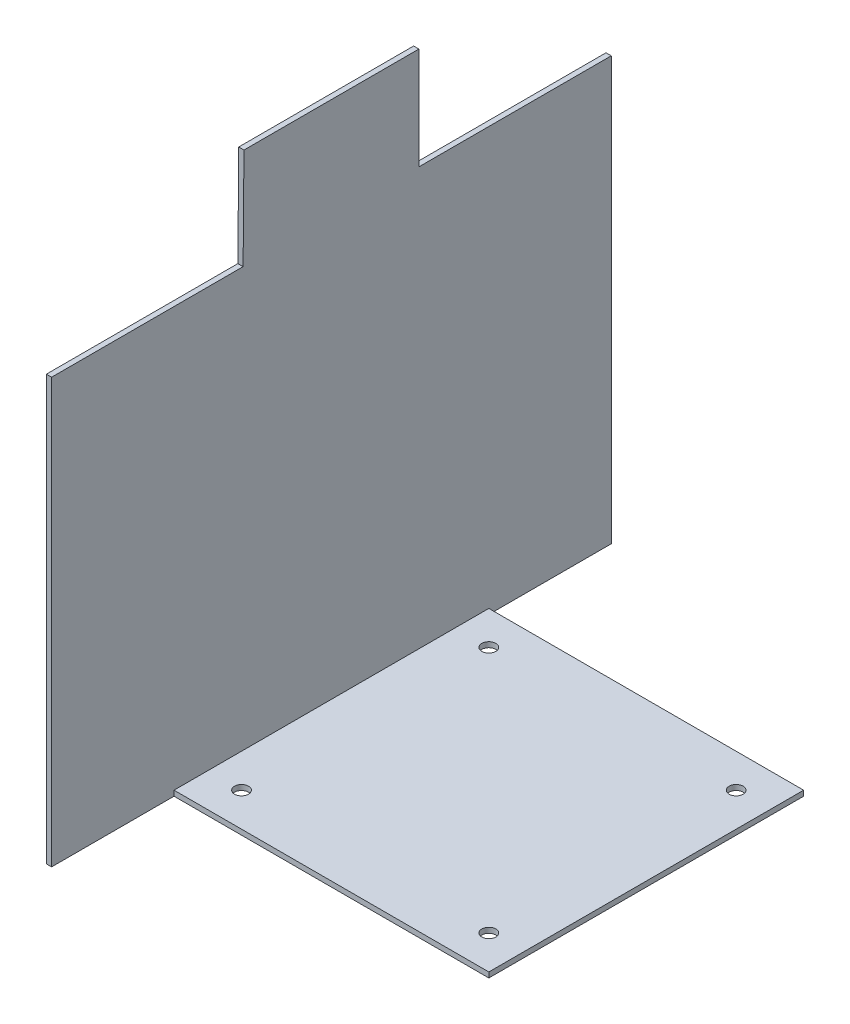
ISO-10303-21;
HEADER;
FILE_DESCRIPTION(('STEP AP214'),'2;1');
FILE_NAME('part.step','',(''),(''),'','','');
FILE_SCHEMA(('AUTOMOTIVE_DESIGN { 1 0 10303 214 1 1 1 1 }'));
ENDSEC;
DATA;
#1=APPLICATION_CONTEXT('core data for automotive mechanical design processes');
#2=APPLICATION_PROTOCOL_DEFINITION('international standard','automotive_design',2000,#1);
#3=PRODUCT_CONTEXT('',#1,'mechanical');
#4=PRODUCT('Part','Part','',(#3));
#5=PRODUCT_RELATED_PRODUCT_CATEGORY('part','',(#4));
#6=PRODUCT_DEFINITION_FORMATION('','',#4);
#7=PRODUCT_DEFINITION_CONTEXT('part definition',#1,'design');
#8=PRODUCT_DEFINITION('design','',#6,#7);
#9=PRODUCT_DEFINITION_SHAPE('','',#8);
#10=(LENGTH_UNIT() NAMED_UNIT(*) SI_UNIT(.MILLI.,.METRE.));
#11=(NAMED_UNIT(*) PLANE_ANGLE_UNIT() SI_UNIT($,.RADIAN.));
#12=(NAMED_UNIT(*) SI_UNIT($,.STERADIAN.) SOLID_ANGLE_UNIT());
#13=UNCERTAINTY_MEASURE_WITH_UNIT(LENGTH_MEASURE(1.E-05),#10,'distance_accuracy_value','');
#14=(GEOMETRIC_REPRESENTATION_CONTEXT(3) GLOBAL_UNCERTAINTY_ASSIGNED_CONTEXT((#13)) GLOBAL_UNIT_ASSIGNED_CONTEXT((#10,
#11,#12)) REPRESENTATION_CONTEXT('',''));
#15=CARTESIAN_POINT('',(0.,0.,0.));
#16=DIRECTION('',(0.,0.,1.));
#17=DIRECTION('',(1.,0.,0.));
#18=AXIS2_PLACEMENT_3D('',#15,#16,#17);
#19=CARTESIAN_POINT('',(3.,0.,0.));
#20=DIRECTION('',(-1.,0.,0.));
#21=DIRECTION('',(0.,0.,1.));
#22=AXIS2_PLACEMENT_3D('',#19,#20,#21);
#23=PLANE('',#22);
#24=DIRECTION('',(0.,0.,1.));
#25=VECTOR('',#24,1.);
#26=CARTESIAN_POINT('',(3.,150.,160.));
#27=LINE('',#26,#25);
#28=CARTESIAN_POINT('',(3.,150.,-49.9999999999999));
#29=VERTEX_POINT('',#28);
#30=CARTESIAN_POINT('',(3.,150.,50.0168067226892));
#31=VERTEX_POINT('',#30);
#32=EDGE_CURVE('E138',#29,#31,#27,.T.);
#33=ORIENTED_EDGE('',*,*,#32,.T.);
#34=DIRECTION('',(0.,0.999964693628955,-0.0084030646523393));
#35=VECTOR('',#34,1.);
#36=CARTESIAN_POINT('',(3.,152.,50.0000000000001));
#37=LINE('',#36,#35);
#38=CARTESIAN_POINT('',(3.,92.5,50.4999999999998));
#39=VERTEX_POINT('',#38);
#40=EDGE_CURVE('E121',#39,#31,#37,.T.);
#41=ORIENTED_EDGE('',*,*,#40,.F.);
#42=DIRECTION('',(0.,0.,-1.));
#43=VECTOR('',#42,1.);
#44=CARTESIAN_POINT('',(3.,92.5,50.4999999999998));
#45=LINE('',#44,#43);
#46=CARTESIAN_POINT('',(3.,92.5,160.));
#47=VERTEX_POINT('',#46);
#48=EDGE_CURVE('E128',#47,#39,#45,.T.);
#49=ORIENTED_EDGE('',*,*,#48,.F.);
#50=DIRECTION('',(0.,-1.,0.));
#51=VECTOR('',#50,1.);
#52=CARTESIAN_POINT('',(3.,-150.,160.));
#53=LINE('',#52,#51);
#54=CARTESIAN_POINT('',(3.,-150.,160.));
#55=VERTEX_POINT('',#54);
#56=EDGE_CURVE('E214',#47,#55,#53,.T.);
#57=ORIENTED_EDGE('',*,*,#56,.T.);
#58=DIRECTION('',(0.,0.,-1.));
#59=VECTOR('',#58,1.);
#60=CARTESIAN_POINT('',(3.,-150.,160.));
#61=LINE('',#60,#59);
#62=CARTESIAN_POINT('',(3.,-150.,90.));
#63=VERTEX_POINT('',#62);
#64=EDGE_CURVE('E217',#55,#63,#61,.T.);
#65=ORIENTED_EDGE('',*,*,#64,.T.);
#66=DIRECTION('',(0.,-1.,0.));
#67=VECTOR('',#66,1.);
#68=CARTESIAN_POINT('',(3.,-147.,90.));
#69=LINE('',#68,#67);
#70=CARTESIAN_POINT('',(3.,-147.,90.));
#71=VERTEX_POINT('',#70);
#72=EDGE_CURVE('E200',#71,#63,#69,.T.);
#73=ORIENTED_EDGE('',*,*,#72,.F.);
#74=DIRECTION('',(0.,0.,-1.));
#75=VECTOR('',#74,1.);
#76=CARTESIAN_POINT('',(3.,-147.,-90.));
#77=LINE('',#76,#75);
#78=CARTESIAN_POINT('',(3.,-147.,-90.));
#79=VERTEX_POINT('',#78);
#80=EDGE_CURVE('E179',#71,#79,#77,.T.);
#81=ORIENTED_EDGE('',*,*,#80,.T.);
#82=DIRECTION('',(0.,-1.,0.));
#83=VECTOR('',#82,1.);
#84=CARTESIAN_POINT('',(3.,-147.,-90.));
#85=LINE('',#84,#83);
#86=CARTESIAN_POINT('',(3.,-150.,-90.));
#87=VERTEX_POINT('',#86);
#88=EDGE_CURVE('E192',#79,#87,#85,.T.);
#89=ORIENTED_EDGE('',*,*,#88,.T.);
#90=CARTESIAN_POINT('',(3.,-150.,-160.));
#91=VERTEX_POINT('',#90);
#92=EDGE_CURVE('E216',#87,#91,#61,.T.);
#93=ORIENTED_EDGE('',*,*,#92,.T.);
#94=DIRECTION('',(0.,1.,0.));
#95=VECTOR('',#94,1.);
#96=CARTESIAN_POINT('',(3.,-150.,-160.));
#97=LINE('',#96,#95);
#98=CARTESIAN_POINT('',(3.,91.6554621848744,-160.));
#99=VERTEX_POINT('',#98);
#100=EDGE_CURVE('E209',#91,#99,#97,.T.);
#101=ORIENTED_EDGE('',*,*,#100,.T.);
#102=DIRECTION('',(0.,0.,-1.));
#103=VECTOR('',#102,1.);
#104=CARTESIAN_POINT('',(3.,91.6554621848744,-49.9999999999999));
#105=LINE('',#104,#103);
#106=CARTESIAN_POINT('',(3.,91.6554621848744,-49.9999999999999));
#107=VERTEX_POINT('',#106);
#108=EDGE_CURVE('E143',#107,#99,#105,.T.);
#109=ORIENTED_EDGE('',*,*,#108,.F.);
#110=DIRECTION('',(0.,-1.,0.));
#111=VECTOR('',#110,1.);
#112=CARTESIAN_POINT('',(3.,152.,-49.9999999999999));
#113=LINE('',#112,#111);
#114=EDGE_CURVE('E141',#29,#107,#113,.T.);
#115=ORIENTED_EDGE('',*,*,#114,.F.);
#116=EDGE_LOOP('',(#33,#41,#49,#57,#65,#73,#81,#89,#93,#101,#109,#115));
#117=FACE_BOUND('',#116,.T.);
#118=ADVANCED_FACE('F33',(#117),#23,.F.);
#119=CARTESIAN_POINT('',(3.,-150.,-160.));
#120=DIRECTION('',(0.,0.,1.));
#121=DIRECTION('',(1.,0.,0.));
#122=AXIS2_PLACEMENT_3D('',#119,#120,#121);
#123=PLANE('',#122);
#124=DIRECTION('',(0.,1.,0.));
#125=VECTOR('',#124,1.);
#126=CARTESIAN_POINT('',(0.,-150.,-160.));
#127=LINE('',#126,#125);
#128=CARTESIAN_POINT('',(0.,-150.,-160.));
#129=VERTEX_POINT('',#128);
#130=CARTESIAN_POINT('',(0.,91.6554621848744,-160.));
#131=VERTEX_POINT('',#130);
#132=EDGE_CURVE('E202',#129,#131,#127,.T.);
#133=ORIENTED_EDGE('',*,*,#132,.T.);
#134=DIRECTION('',(1.,0.,0.));
#135=VECTOR('',#134,1.);
#136=CARTESIAN_POINT('',(3.,91.6554621848744,-160.));
#137=LINE('',#136,#135);
#138=EDGE_CURVE('E148',#131,#99,#137,.T.);
#139=ORIENTED_EDGE('',*,*,#138,.T.);
#140=ORIENTED_EDGE('',*,*,#100,.F.);
#141=DIRECTION('',(-1.,0.,0.));
#142=VECTOR('',#141,1.);
#143=CARTESIAN_POINT('',(3.,-150.,-160.));
#144=LINE('',#143,#142);
#145=EDGE_CURVE('E220',#91,#129,#144,.T.);
#146=ORIENTED_EDGE('',*,*,#145,.T.);
#147=EDGE_LOOP('',(#133,#139,#140,#146));
#148=FACE_BOUND('',#147,.T.);
#149=ADVANCED_FACE('F35',(#148),#123,.F.);
#150=CARTESIAN_POINT('',(3.,150.,160.));
#151=DIRECTION('',(0.,-1.,0.));
#152=DIRECTION('',(0.,0.,-1.));
#153=AXIS2_PLACEMENT_3D('',#150,#151,#152);
#154=PLANE('',#153);
#155=DIRECTION('',(0.,0.,1.));
#156=VECTOR('',#155,1.);
#157=CARTESIAN_POINT('',(0.,150.,160.));
#158=LINE('',#157,#156);
#159=CARTESIAN_POINT('',(0.,150.,-49.9999999999999));
#160=VERTEX_POINT('',#159);
#161=CARTESIAN_POINT('',(0.,150.,50.0168067226892));
#162=VERTEX_POINT('',#161);
#163=EDGE_CURVE('E223',#160,#162,#158,.T.);
#164=ORIENTED_EDGE('',*,*,#163,.T.);
#165=DIRECTION('',(1.,0.,0.));
#166=VECTOR('',#165,1.);
#167=CARTESIAN_POINT('',(3.,150.,50.0168067226892));
#168=LINE('',#167,#166);
#169=EDGE_CURVE('E152',#162,#31,#168,.T.);
#170=ORIENTED_EDGE('',*,*,#169,.T.);
#171=ORIENTED_EDGE('',*,*,#32,.F.);
#172=DIRECTION('',(-1.,0.,0.));
#173=VECTOR('',#172,1.);
#174=CARTESIAN_POINT('',(3.,150.,-49.9999999999999));
#175=LINE('',#174,#173);
#176=EDGE_CURVE('E125',#29,#160,#175,.T.);
#177=ORIENTED_EDGE('',*,*,#176,.T.);
#178=EDGE_LOOP('',(#164,#170,#171,#177));
#179=FACE_BOUND('',#178,.T.);
#180=ADVANCED_FACE('F289',(#179),#154,.F.);
#181=CARTESIAN_POINT('',(3.,-150.,160.));
#182=DIRECTION('',(0.,0.,-1.));
#183=DIRECTION('',(-1.,0.,0.));
#184=AXIS2_PLACEMENT_3D('',#181,#182,#183);
#185=PLANE('',#184);
#186=ORIENTED_EDGE('',*,*,#56,.F.);
#187=DIRECTION('',(-1.,0.,0.));
#188=VECTOR('',#187,1.);
#189=CARTESIAN_POINT('',(3.,92.5,160.));
#190=LINE('',#189,#188);
#191=CARTESIAN_POINT('',(0.,92.5,160.));
#192=VERTEX_POINT('',#191);
#193=EDGE_CURVE('E131',#47,#192,#190,.T.);
#194=ORIENTED_EDGE('',*,*,#193,.T.);
#195=DIRECTION('',(0.,-1.,0.));
#196=VECTOR('',#195,1.);
#197=CARTESIAN_POINT('',(0.,-150.,160.));
#198=LINE('',#197,#196);
#199=CARTESIAN_POINT('',(0.,-150.,160.));
#200=VERTEX_POINT('',#199);
#201=EDGE_CURVE('E226',#192,#200,#198,.T.);
#202=ORIENTED_EDGE('',*,*,#201,.T.);
#203=DIRECTION('',(-1.,0.,0.));
#204=VECTOR('',#203,1.);
#205=CARTESIAN_POINT('',(3.,-150.,160.));
#206=LINE('',#205,#204);
#207=EDGE_CURVE('E231',#55,#200,#206,.T.);
#208=ORIENTED_EDGE('',*,*,#207,.F.);
#209=EDGE_LOOP('',(#186,#194,#202,#208));
#210=FACE_BOUND('',#209,.T.);
#211=ADVANCED_FACE('F240',(#210),#185,.F.);
#212=CARTESIAN_POINT('',(3.,-150.,160.));
#213=DIRECTION('',(0.,1.,0.));
#214=DIRECTION('',(0.,0.,1.));
#215=AXIS2_PLACEMENT_3D('',#212,#213,#214);
#216=PLANE('',#215);
#217=DIRECTION('',(0.,0.,-1.));
#218=VECTOR('',#217,1.);
#219=CARTESIAN_POINT('',(0.,-150.,160.));
#220=LINE('',#219,#218);
#221=EDGE_CURVE('E212',#200,#129,#220,.T.);
#222=ORIENTED_EDGE('',*,*,#221,.T.);
#223=ORIENTED_EDGE('',*,*,#145,.F.);
#224=ORIENTED_EDGE('',*,*,#92,.F.);
#225=DIRECTION('',(1.,0.,0.));
#226=VECTOR('',#225,1.);
#227=CARTESIAN_POINT('',(183.,-150.,-90.));
#228=LINE('',#227,#226);
#229=CARTESIAN_POINT('',(183.,-150.,-90.));
#230=VERTEX_POINT('',#229);
#231=EDGE_CURVE('E176',#87,#230,#228,.T.);
#232=ORIENTED_EDGE('',*,*,#231,.T.);
#233=DIRECTION('',(0.,0.,1.));
#234=VECTOR('',#233,1.);
#235=CARTESIAN_POINT('',(183.,-150.,90.));
#236=LINE('',#235,#234);
#237=CARTESIAN_POINT('',(183.,-150.,90.));
#238=VERTEX_POINT('',#237);
#239=EDGE_CURVE('E195',#230,#238,#236,.T.);
#240=ORIENTED_EDGE('',*,*,#239,.T.);
#241=DIRECTION('',(-1.,0.,0.));
#242=VECTOR('',#241,1.);
#243=CARTESIAN_POINT('',(3.,-150.,90.));
#244=LINE('',#243,#242);
#245=EDGE_CURVE('E183',#238,#63,#244,.T.);
#246=ORIENTED_EDGE('',*,*,#245,.T.);
#247=ORIENTED_EDGE('',*,*,#64,.F.);
#248=ORIENTED_EDGE('',*,*,#207,.T.);
#249=EDGE_LOOP('',(#222,#223,#224,#232,#240,#246,#247,#248));
#250=FACE_BOUND('',#249,.T.);
#251=CARTESIAN_POINT('',(163.71,-150.,-70.7099999999999));
#252=DIRECTION('',(0.,-1.,0.));
#253=DIRECTION('',(0.,0.,-1.));
#254=AXIS2_PLACEMENT_3D('',#251,#252,#253);
#255=CIRCLE('',#254,3.99999999999999);
#256=CARTESIAN_POINT('',(163.71,-150.,-74.7099999999999));
#257=VERTEX_POINT('',#256);
#258=EDGE_CURVE('E154',#257,#257,#255,.T.);
#259=ORIENTED_EDGE('',*,*,#258,.F.);
#260=EDGE_LOOP('',(#259));
#261=FACE_BOUND('',#260,.T.);
#262=CARTESIAN_POINT('',(163.71,-150.,70.71));
#263=DIRECTION('',(0.,-1.,0.));
#264=DIRECTION('',(0.,0.,-1.));
#265=AXIS2_PLACEMENT_3D('',#262,#263,#264);
#266=CIRCLE('',#265,3.99999999999999);
#267=CARTESIAN_POINT('',(163.71,-150.,66.71));
#268=VERTEX_POINT('',#267);
#269=EDGE_CURVE('E158',#268,#268,#266,.T.);
#270=ORIENTED_EDGE('',*,*,#269,.F.);
#271=EDGE_LOOP('',(#270));
#272=FACE_BOUND('',#271,.T.);
#273=CARTESIAN_POINT('',(22.29,-150.,70.71));
#274=DIRECTION('',(0.,-1.,0.));
#275=DIRECTION('',(0.,0.,-1.));
#276=AXIS2_PLACEMENT_3D('',#273,#274,#275);
#277=CIRCLE('',#276,4.00000000000001);
#278=CARTESIAN_POINT('',(22.29,-150.,66.71));
#279=VERTEX_POINT('',#278);
#280=EDGE_CURVE('E164',#279,#279,#277,.T.);
#281=ORIENTED_EDGE('',*,*,#280,.F.);
#282=EDGE_LOOP('',(#281));
#283=FACE_BOUND('',#282,.T.);
#284=CARTESIAN_POINT('',(22.29,-150.,-70.71));
#285=DIRECTION('',(0.,-1.,0.));
#286=DIRECTION('',(0.,0.,-1.));
#287=AXIS2_PLACEMENT_3D('',#284,#285,#286);
#288=CIRCLE('',#287,4.00000000000001);
#289=CARTESIAN_POINT('',(22.29,-150.,-74.71));
#290=VERTEX_POINT('',#289);
#291=EDGE_CURVE('E170',#290,#290,#288,.T.);
#292=ORIENTED_EDGE('',*,*,#291,.F.);
#293=EDGE_LOOP('',(#292));
#294=FACE_BOUND('',#293,.T.);
#295=ADVANCED_FACE('F248',(#250,#261,#272,#283,#294),#216,.F.);
#296=CARTESIAN_POINT('',(0.,0.,0.));
#297=DIRECTION('',(-1.,0.,0.));
#298=DIRECTION('',(0.,0.,1.));
#299=AXIS2_PLACEMENT_3D('',#296,#297,#298);
#300=PLANE('',#299);
#301=DIRECTION('',(0.,-0.999964693628954,0.0084030646523393));
#302=VECTOR('',#301,1.);
#303=CARTESIAN_POINT('',(0.,0.430871345854851,51.2736901567569));
#304=LINE('',#303,#302);
#305=CARTESIAN_POINT('',(0.,92.5,50.4999999999998));
#306=VERTEX_POINT('',#305);
#307=EDGE_CURVE('E11',#162,#306,#304,.T.);
#308=ORIENTED_EDGE('',*,*,#307,.F.);
#309=ORIENTED_EDGE('',*,*,#163,.F.);
#310=DIRECTION('',(0.,1.,0.));
#311=VECTOR('',#310,1.);
#312=CARTESIAN_POINT('',(0.,0.,-49.9999999999999));
#313=LINE('',#312,#311);
#314=CARTESIAN_POINT('',(0.,91.6554621848744,-49.9999999999999));
#315=VERTEX_POINT('',#314);
#316=EDGE_CURVE('E234',#315,#160,#313,.T.);
#317=ORIENTED_EDGE('',*,*,#316,.F.);
#318=DIRECTION('',(0.,0.,1.));
#319=VECTOR('',#318,1.);
#320=CARTESIAN_POINT('',(0.,91.6554621848744,0.));
#321=LINE('',#320,#319);
#322=EDGE_CURVE('E236',#131,#315,#321,.T.);
#323=ORIENTED_EDGE('',*,*,#322,.F.);
#324=ORIENTED_EDGE('',*,*,#132,.F.);
#325=ORIENTED_EDGE('',*,*,#221,.F.);
#326=ORIENTED_EDGE('',*,*,#201,.F.);
#327=DIRECTION('',(0.,0.,1.));
#328=VECTOR('',#327,1.);
#329=CARTESIAN_POINT('',(0.,92.5,0.));
#330=LINE('',#329,#328);
#331=EDGE_CURVE('E41',#306,#192,#330,.T.);
#332=ORIENTED_EDGE('',*,*,#331,.F.);
#333=EDGE_LOOP('',(#308,#309,#317,#323,#324,#325,#326,#332));
#334=FACE_BOUND('',#333,.T.);
#335=ADVANCED_FACE('F243',(#334),#300,.T.);
#336=CARTESIAN_POINT('',(3.,-147.,90.));
#337=DIRECTION('',(0.,0.,1.));
#338=DIRECTION('',(1.,0.,0.));
#339=AXIS2_PLACEMENT_3D('',#336,#337,#338);
#340=PLANE('',#339);
#341=ORIENTED_EDGE('',*,*,#245,.F.);
#342=DIRECTION('',(0.,-1.,0.));
#343=VECTOR('',#342,1.);
#344=CARTESIAN_POINT('',(183.,-147.,90.));
#345=LINE('',#344,#343);
#346=CARTESIAN_POINT('',(183.,-147.,90.));
#347=VERTEX_POINT('',#346);
#348=EDGE_CURVE('E203',#347,#238,#345,.T.);
#349=ORIENTED_EDGE('',*,*,#348,.F.);
#350=DIRECTION('',(-1.,0.,0.));
#351=VECTOR('',#350,1.);
#352=CARTESIAN_POINT('',(3.,-147.,90.));
#353=LINE('',#352,#351);
#354=EDGE_CURVE('E189',#347,#71,#353,.T.);
#355=ORIENTED_EDGE('',*,*,#354,.T.);
#356=ORIENTED_EDGE('',*,*,#72,.T.);
#357=EDGE_LOOP('',(#341,#349,#355,#356));
#358=FACE_BOUND('',#357,.T.);
#359=ADVANCED_FACE('F265',(#358),#340,.T.);
#360=CARTESIAN_POINT('',(183.,-147.,90.));
#361=DIRECTION('',(1.,0.,0.));
#362=DIRECTION('',(0.,0.,-1.));
#363=AXIS2_PLACEMENT_3D('',#360,#361,#362);
#364=PLANE('',#363);
#365=ORIENTED_EDGE('',*,*,#239,.F.);
#366=DIRECTION('',(0.,-1.,0.));
#367=VECTOR('',#366,1.);
#368=CARTESIAN_POINT('',(183.,-147.,-90.));
#369=LINE('',#368,#367);
#370=CARTESIAN_POINT('',(183.,-147.,-90.));
#371=VERTEX_POINT('',#370);
#372=EDGE_CURVE('E205',#371,#230,#369,.T.);
#373=ORIENTED_EDGE('',*,*,#372,.F.);
#374=DIRECTION('',(0.,0.,1.));
#375=VECTOR('',#374,1.);
#376=CARTESIAN_POINT('',(183.,-147.,90.));
#377=LINE('',#376,#375);
#378=EDGE_CURVE('E186',#371,#347,#377,.T.);
#379=ORIENTED_EDGE('',*,*,#378,.T.);
#380=ORIENTED_EDGE('',*,*,#348,.T.);
#381=EDGE_LOOP('',(#365,#373,#379,#380));
#382=FACE_BOUND('',#381,.T.);
#383=ADVANCED_FACE('F262',(#382),#364,.T.);
#384=CARTESIAN_POINT('',(183.,-147.,-90.));
#385=DIRECTION('',(0.,0.,-1.));
#386=DIRECTION('',(-1.,0.,0.));
#387=AXIS2_PLACEMENT_3D('',#384,#385,#386);
#388=PLANE('',#387);
#389=ORIENTED_EDGE('',*,*,#231,.F.);
#390=ORIENTED_EDGE('',*,*,#88,.F.);
#391=DIRECTION('',(1.,0.,0.));
#392=VECTOR('',#391,1.);
#393=CARTESIAN_POINT('',(183.,-147.,-90.));
#394=LINE('',#393,#392);
#395=EDGE_CURVE('E182',#79,#371,#394,.T.);
#396=ORIENTED_EDGE('',*,*,#395,.T.);
#397=ORIENTED_EDGE('',*,*,#372,.T.);
#398=EDGE_LOOP('',(#389,#390,#396,#397));
#399=FACE_BOUND('',#398,.T.);
#400=ADVANCED_FACE('F258',(#399),#388,.T.);
#401=CARTESIAN_POINT('',(0.,-147.,0.));
#402=DIRECTION('',(0.,1.,0.));
#403=DIRECTION('',(0.,0.,1.));
#404=AXIS2_PLACEMENT_3D('',#401,#402,#403);
#405=PLANE('',#404);
#406=CARTESIAN_POINT('',(163.71,-147.,-70.7099999999999));
#407=DIRECTION('',(0.,-1.,0.));
#408=DIRECTION('',(0.,0.,-1.));
#409=AXIS2_PLACEMENT_3D('',#406,#407,#408);
#410=CIRCLE('',#409,3.99999999999999);
#411=CARTESIAN_POINT('',(163.71,-147.,-74.7099999999999));
#412=VERTEX_POINT('',#411);
#413=EDGE_CURVE('E155',#412,#412,#410,.T.);
#414=ORIENTED_EDGE('',*,*,#413,.T.);
#415=EDGE_LOOP('',(#414));
#416=FACE_BOUND('',#415,.T.);
#417=CARTESIAN_POINT('',(163.71,-147.,70.71));
#418=DIRECTION('',(0.,-1.,0.));
#419=DIRECTION('',(0.,0.,-1.));
#420=AXIS2_PLACEMENT_3D('',#417,#418,#419);
#421=CIRCLE('',#420,3.99999999999999);
#422=CARTESIAN_POINT('',(163.71,-147.,66.71));
#423=VERTEX_POINT('',#422);
#424=EDGE_CURVE('E161',#423,#423,#421,.T.);
#425=ORIENTED_EDGE('',*,*,#424,.T.);
#426=EDGE_LOOP('',(#425));
#427=FACE_BOUND('',#426,.T.);
#428=CARTESIAN_POINT('',(22.29,-147.,70.71));
#429=DIRECTION('',(0.,-1.,0.));
#430=DIRECTION('',(0.,0.,-1.));
#431=AXIS2_PLACEMENT_3D('',#428,#429,#430);
#432=CIRCLE('',#431,4.00000000000001);
#433=CARTESIAN_POINT('',(22.29,-147.,66.71));
#434=VERTEX_POINT('',#433);
#435=EDGE_CURVE('E167',#434,#434,#432,.T.);
#436=ORIENTED_EDGE('',*,*,#435,.T.);
#437=EDGE_LOOP('',(#436));
#438=FACE_BOUND('',#437,.T.);
#439=CARTESIAN_POINT('',(22.29,-147.,-70.71));
#440=DIRECTION('',(0.,-1.,0.));
#441=DIRECTION('',(0.,0.,-1.));
#442=AXIS2_PLACEMENT_3D('',#439,#440,#441);
#443=CIRCLE('',#442,4.00000000000001);
#444=CARTESIAN_POINT('',(22.29,-147.,-74.71));
#445=VERTEX_POINT('',#444);
#446=EDGE_CURVE('E173',#445,#445,#443,.T.);
#447=ORIENTED_EDGE('',*,*,#446,.T.);
#448=EDGE_LOOP('',(#447));
#449=FACE_BOUND('',#448,.T.);
#450=ORIENTED_EDGE('',*,*,#80,.F.);
#451=ORIENTED_EDGE('',*,*,#354,.F.);
#452=ORIENTED_EDGE('',*,*,#378,.F.);
#453=ORIENTED_EDGE('',*,*,#395,.F.);
#454=EDGE_LOOP('',(#450,#451,#452,#453));
#455=FACE_BOUND('',#454,.T.);
#456=ADVANCED_FACE('F268',(#416,#427,#438,#449,#455),#405,.T.);
#457=CARTESIAN_POINT('',(22.29,-147.,-70.71));
#458=DIRECTION('',(0.,-1.,0.));
#459=DIRECTION('',(0.,0.,-1.));
#460=AXIS2_PLACEMENT_3D('',#457,#458,#459);
#461=CYLINDRICAL_SURFACE('',#460,4.00000000000001);
#462=ORIENTED_EDGE('',*,*,#446,.F.);
#463=EDGE_LOOP('',(#462));
#464=FACE_BOUND('',#463,.T.);
#465=ORIENTED_EDGE('',*,*,#291,.T.);
#466=EDGE_LOOP('',(#465));
#467=FACE_BOUND('',#466,.T.);
#468=ADVANCED_FACE('F270',(#464,#467),#461,.F.);
#469=CARTESIAN_POINT('',(22.29,-147.,70.71));
#470=DIRECTION('',(0.,-1.,0.));
#471=DIRECTION('',(0.,0.,-1.));
#472=AXIS2_PLACEMENT_3D('',#469,#470,#471);
#473=CYLINDRICAL_SURFACE('',#472,4.00000000000001);
#474=ORIENTED_EDGE('',*,*,#435,.F.);
#475=EDGE_LOOP('',(#474));
#476=FACE_BOUND('',#475,.T.);
#477=ORIENTED_EDGE('',*,*,#280,.T.);
#478=EDGE_LOOP('',(#477));
#479=FACE_BOUND('',#478,.T.);
#480=ADVANCED_FACE('F277',(#476,#479),#473,.F.);
#481=CARTESIAN_POINT('',(163.71,-147.,70.71));
#482=DIRECTION('',(0.,-1.,0.));
#483=DIRECTION('',(0.,0.,-1.));
#484=AXIS2_PLACEMENT_3D('',#481,#482,#483);
#485=CYLINDRICAL_SURFACE('',#484,3.99999999999999);
#486=ORIENTED_EDGE('',*,*,#424,.F.);
#487=EDGE_LOOP('',(#486));
#488=FACE_BOUND('',#487,.T.);
#489=ORIENTED_EDGE('',*,*,#269,.T.);
#490=EDGE_LOOP('',(#489));
#491=FACE_BOUND('',#490,.T.);
#492=ADVANCED_FACE('F319',(#488,#491),#485,.F.);
#493=CARTESIAN_POINT('',(163.71,-147.,-70.7099999999999));
#494=DIRECTION('',(0.,-1.,0.));
#495=DIRECTION('',(0.,0.,-1.));
#496=AXIS2_PLACEMENT_3D('',#493,#494,#495);
#497=CYLINDRICAL_SURFACE('',#496,3.99999999999999);
#498=ORIENTED_EDGE('',*,*,#413,.F.);
#499=EDGE_LOOP('',(#498));
#500=FACE_BOUND('',#499,.T.);
#501=ORIENTED_EDGE('',*,*,#258,.T.);
#502=EDGE_LOOP('',(#501));
#503=FACE_BOUND('',#502,.T.);
#504=ADVANCED_FACE('F312',(#500,#503),#497,.F.);
#505=CARTESIAN_POINT('',(-7.,91.6554621848744,-49.9999999999999));
#506=DIRECTION('',(0.,-1.,0.));
#507=DIRECTION('',(0.,0.,-1.));
#508=AXIS2_PLACEMENT_3D('',#505,#506,#507);
#509=PLANE('',#508);
#510=ORIENTED_EDGE('',*,*,#322,.T.);
#511=DIRECTION('',(1.,0.,0.));
#512=VECTOR('',#511,1.);
#513=CARTESIAN_POINT('',(-7.,91.6554621848744,-49.9999999999999));
#514=LINE('',#513,#512);
#515=EDGE_CURVE('E55',#315,#107,#514,.T.);
#516=ORIENTED_EDGE('',*,*,#515,.T.);
#517=ORIENTED_EDGE('',*,*,#108,.T.);
#518=ORIENTED_EDGE('',*,*,#138,.F.);
#519=EDGE_LOOP('',(#510,#516,#517,#518));
#520=FACE_BOUND('',#519,.T.);
#521=ADVANCED_FACE('F305',(#520),#509,.F.);
#522=CARTESIAN_POINT('',(-7.,152.,-49.9999999999999));
#523=DIRECTION('',(0.,0.,1.));
#524=DIRECTION('',(0.,-1.,0.));
#525=AXIS2_PLACEMENT_3D('',#522,#523,#524);
#526=PLANE('',#525);
#527=ORIENTED_EDGE('',*,*,#114,.T.);
#528=ORIENTED_EDGE('',*,*,#515,.F.);
#529=ORIENTED_EDGE('',*,*,#316,.T.);
#530=ORIENTED_EDGE('',*,*,#176,.F.);
#531=EDGE_LOOP('',(#527,#528,#529,#530));
#532=FACE_BOUND('',#531,.T.);
#533=ADVANCED_FACE('F303',(#532),#526,.F.);
#534=CARTESIAN_POINT('',(-7.,152.,50.0000000000001));
#535=DIRECTION('',(0.,-0.0084030646523393,-0.999964693628954));
#536=DIRECTION('',(0.,0.999964693628954,-0.0084030646523393));
#537=AXIS2_PLACEMENT_3D('',#534,#535,#536);
#538=PLANE('',#537);
#539=ORIENTED_EDGE('',*,*,#307,.T.);
#540=DIRECTION('',(1.,0.,0.));
#541=VECTOR('',#540,1.);
#542=CARTESIAN_POINT('',(-7.,92.5,50.4999999999998));
#543=LINE('',#542,#541);
#544=EDGE_CURVE('E48',#306,#39,#543,.T.);
#545=ORIENTED_EDGE('',*,*,#544,.T.);
#546=ORIENTED_EDGE('',*,*,#40,.T.);
#547=ORIENTED_EDGE('',*,*,#169,.F.);
#548=EDGE_LOOP('',(#539,#545,#546,#547));
#549=FACE_BOUND('',#548,.T.);
#550=ADVANCED_FACE('F119',(#549),#538,.F.);
#551=CARTESIAN_POINT('',(-7.,92.5,50.4999999999998));
#552=DIRECTION('',(0.,-1.,0.));
#553=DIRECTION('',(0.,0.,-1.));
#554=AXIS2_PLACEMENT_3D('',#551,#552,#553);
#555=PLANE('',#554);
#556=ORIENTED_EDGE('',*,*,#48,.T.);
#557=ORIENTED_EDGE('',*,*,#544,.F.);
#558=ORIENTED_EDGE('',*,*,#331,.T.);
#559=ORIENTED_EDGE('',*,*,#193,.F.);
#560=EDGE_LOOP('',(#556,#557,#558,#559));
#561=FACE_BOUND('',#560,.T.);
#562=ADVANCED_FACE('F129',(#561),#555,.F.);
#563=CLOSED_SHELL('',(#118,#149,#180,#211,#295,#335,#359,#383,#400,#456,#468,#480,#492,#504,
#521,#533,#550,#562));
#564=MANIFOLD_SOLID_BREP('B2',#563);
#565=ADVANCED_BREP_SHAPE_REPRESENTATION('',(#18,#564),#14);
#566=SHAPE_DEFINITION_REPRESENTATION(#9,#565);
ENDSEC;
END-ISO-10303-21;
